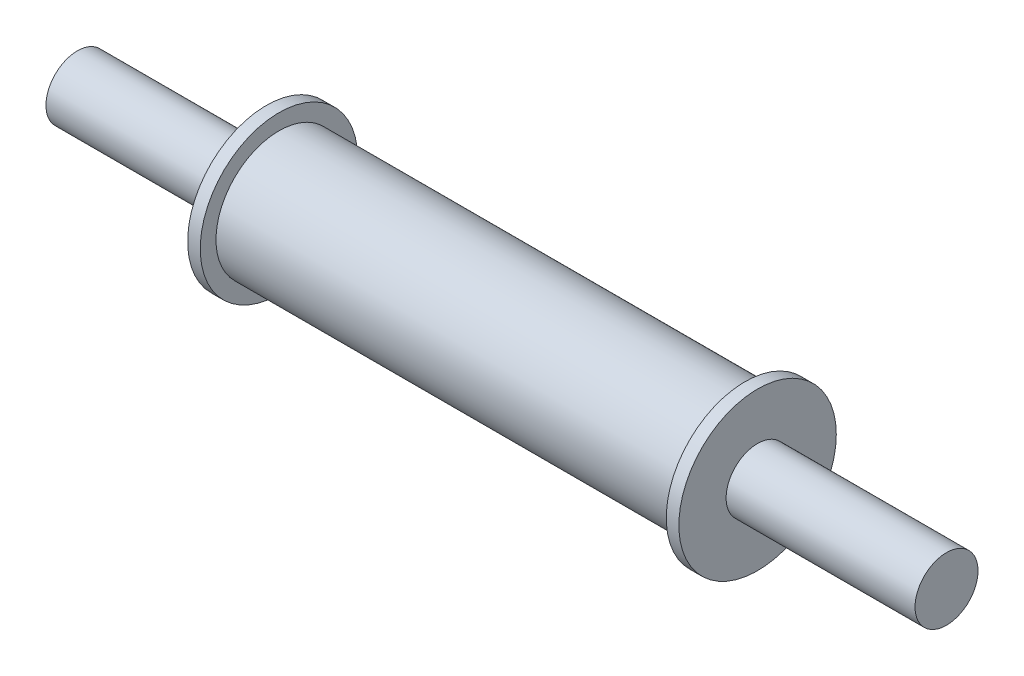
ISO-10303-21;
HEADER;
FILE_DESCRIPTION(('STEP AP214'),'2;1');
FILE_NAME('part.step','',(''),(''),'','','');
FILE_SCHEMA(('AUTOMOTIVE_DESIGN { 1 0 10303 214 1 1 1 1 }'));
ENDSEC;
DATA;
#1=APPLICATION_CONTEXT('core data for automotive mechanical design processes');
#2=APPLICATION_PROTOCOL_DEFINITION('international standard','automotive_design',2000,#1);
#3=PRODUCT_CONTEXT('',#1,'mechanical');
#4=PRODUCT('Part','Part','',(#3));
#5=PRODUCT_RELATED_PRODUCT_CATEGORY('part','',(#4));
#6=PRODUCT_DEFINITION_FORMATION('','',#4);
#7=PRODUCT_DEFINITION_CONTEXT('part definition',#1,'design');
#8=PRODUCT_DEFINITION('design','',#6,#7);
#9=PRODUCT_DEFINITION_SHAPE('','',#8);
#10=(LENGTH_UNIT() NAMED_UNIT(*) SI_UNIT(.MILLI.,.METRE.));
#11=(NAMED_UNIT(*) PLANE_ANGLE_UNIT() SI_UNIT($,.RADIAN.));
#12=(NAMED_UNIT(*) SI_UNIT($,.STERADIAN.) SOLID_ANGLE_UNIT());
#13=UNCERTAINTY_MEASURE_WITH_UNIT(LENGTH_MEASURE(1.E-05),#10,'distance_accuracy_value','');
#14=(GEOMETRIC_REPRESENTATION_CONTEXT(3) GLOBAL_UNCERTAINTY_ASSIGNED_CONTEXT((#13)) GLOBAL_UNIT_ASSIGNED_CONTEXT((#10,
#11,#12)) REPRESENTATION_CONTEXT('',''));
#15=CARTESIAN_POINT('',(0.,0.,0.));
#16=DIRECTION('',(0.,0.,1.));
#17=DIRECTION('',(1.,0.,0.));
#18=AXIS2_PLACEMENT_3D('',#15,#16,#17);
#19=CARTESIAN_POINT('',(37.,0.,0.));
#20=DIRECTION('',(-1.,0.,0.));
#21=DIRECTION('',(0.,0.,1.));
#22=AXIS2_PLACEMENT_3D('',#19,#20,#21);
#23=CYLINDRICAL_SURFACE('',#22,10.);
#24=CARTESIAN_POINT('',(37.,0.,0.));
#25=DIRECTION('',(1.,0.,0.));
#26=DIRECTION('',(0.,0.,-1.));
#27=AXIS2_PLACEMENT_3D('',#24,#25,#26);
#28=CIRCLE('',#27,10.);
#29=CARTESIAN_POINT('',(37.,0.,-10.));
#30=VERTEX_POINT('',#29);
#31=EDGE_CURVE('E34',#30,#30,#28,.T.);
#32=ORIENTED_EDGE('',*,*,#31,.F.);
#33=EDGE_LOOP('',(#32));
#34=FACE_BOUND('',#33,.T.);
#35=CARTESIAN_POINT('',(-37.,0.,0.));
#36=DIRECTION('',(1.,0.,0.));
#37=DIRECTION('',(0.,0.,-1.));
#38=AXIS2_PLACEMENT_3D('',#35,#36,#37);
#39=CIRCLE('',#38,10.);
#40=CARTESIAN_POINT('',(-37.,0.,-10.));
#41=VERTEX_POINT('',#40);
#42=EDGE_CURVE('E53',#41,#41,#39,.T.);
#43=ORIENTED_EDGE('',*,*,#42,.T.);
#44=EDGE_LOOP('',(#43));
#45=FACE_BOUND('',#44,.T.);
#46=ADVANCED_FACE('F31',(#34,#45),#23,.T.);
#47=CARTESIAN_POINT('',(39.,0.,0.));
#48=DIRECTION('',(-1.,0.,0.));
#49=DIRECTION('',(0.,0.,1.));
#50=AXIS2_PLACEMENT_3D('',#47,#48,#49);
#51=CYLINDRICAL_SURFACE('',#50,12.5);
#52=CARTESIAN_POINT('',(39.,0.,0.));
#53=DIRECTION('',(1.,0.,0.));
#54=DIRECTION('',(0.,0.,-1.));
#55=AXIS2_PLACEMENT_3D('',#52,#53,#54);
#56=CIRCLE('',#55,12.5);
#57=CARTESIAN_POINT('',(39.,0.,-12.5));
#58=VERTEX_POINT('',#57);
#59=EDGE_CURVE('E42',#58,#58,#56,.T.);
#60=ORIENTED_EDGE('',*,*,#59,.F.);
#61=EDGE_LOOP('',(#60));
#62=FACE_BOUND('',#61,.T.);
#63=CARTESIAN_POINT('',(37.,0.,0.));
#64=DIRECTION('',(1.,0.,0.));
#65=DIRECTION('',(0.,0.,-1.));
#66=AXIS2_PLACEMENT_3D('',#63,#64,#65);
#67=CIRCLE('',#66,12.5);
#68=CARTESIAN_POINT('',(37.,0.,-12.5));
#69=VERTEX_POINT('',#68);
#70=EDGE_CURVE('E48',#69,#69,#67,.T.);
#71=ORIENTED_EDGE('',*,*,#70,.T.);
#72=EDGE_LOOP('',(#71));
#73=FACE_BOUND('',#72,.T.);
#74=ADVANCED_FACE('F85',(#62,#73),#51,.T.);
#75=CARTESIAN_POINT('',(39.,0.,0.));
#76=DIRECTION('',(1.,0.,0.));
#77=DIRECTION('',(0.,0.,-1.));
#78=AXIS2_PLACEMENT_3D('',#75,#76,#77);
#79=PLANE('',#78);
#80=CARTESIAN_POINT('',(39.,0.,0.));
#81=DIRECTION('',(1.,0.,0.));
#82=DIRECTION('',(0.,0.,-1.));
#83=AXIS2_PLACEMENT_3D('',#80,#81,#82);
#84=CIRCLE('',#83,5.);
#85=CARTESIAN_POINT('',(39.,0.,-5.));
#86=VERTEX_POINT('',#85);
#87=EDGE_CURVE('E10',#86,#86,#84,.T.);
#88=ORIENTED_EDGE('',*,*,#87,.F.);
#89=EDGE_LOOP('',(#88));
#90=FACE_BOUND('',#89,.T.);
#91=ORIENTED_EDGE('',*,*,#59,.T.);
#92=EDGE_LOOP('',(#91));
#93=FACE_BOUND('',#92,.T.);
#94=ADVANCED_FACE('F90',(#90,#93),#79,.T.);
#95=CARTESIAN_POINT('',(37.,0.,0.));
#96=DIRECTION('',(1.,0.,0.));
#97=DIRECTION('',(0.,0.,-1.));
#98=AXIS2_PLACEMENT_3D('',#95,#96,#97);
#99=PLANE('',#98);
#100=ORIENTED_EDGE('',*,*,#31,.T.);
#101=EDGE_LOOP('',(#100));
#102=FACE_BOUND('',#101,.T.);
#103=ORIENTED_EDGE('',*,*,#70,.F.);
#104=EDGE_LOOP('',(#103));
#105=FACE_BOUND('',#104,.T.);
#106=ADVANCED_FACE('F94',(#102,#105),#99,.F.);
#107=CARTESIAN_POINT('',(69.,0.,0.));
#108=DIRECTION('',(-1.,0.,0.));
#109=DIRECTION('',(0.,0.,1.));
#110=AXIS2_PLACEMENT_3D('',#107,#108,#109);
#111=CYLINDRICAL_SURFACE('',#110,5.);
#112=CARTESIAN_POINT('',(69.,0.,0.));
#113=DIRECTION('',(1.,0.,0.));
#114=DIRECTION('',(0.,0.,-1.));
#115=AXIS2_PLACEMENT_3D('',#112,#113,#114);
#116=CIRCLE('',#115,5.);
#117=CARTESIAN_POINT('',(69.,0.,-5.));
#118=VERTEX_POINT('',#117);
#119=EDGE_CURVE('E45',#118,#118,#116,.T.);
#120=ORIENTED_EDGE('',*,*,#119,.F.);
#121=EDGE_LOOP('',(#120));
#122=FACE_BOUND('',#121,.T.);
#123=ORIENTED_EDGE('',*,*,#87,.T.);
#124=EDGE_LOOP('',(#123));
#125=FACE_BOUND('',#124,.T.);
#126=ADVANCED_FACE('F97',(#122,#125),#111,.T.);
#127=CARTESIAN_POINT('',(69.,0.,0.));
#128=DIRECTION('',(1.,0.,0.));
#129=DIRECTION('',(0.,0.,-1.));
#130=AXIS2_PLACEMENT_3D('',#127,#128,#129);
#131=PLANE('',#130);
#132=ORIENTED_EDGE('',*,*,#119,.T.);
#133=EDGE_LOOP('',(#132));
#134=FACE_BOUND('',#133,.T.);
#135=ADVANCED_FACE('F103',(#134),#131,.T.);
#136=CARTESIAN_POINT('',(-39.,0.,0.));
#137=DIRECTION('',(1.,0.,0.));
#138=DIRECTION('',(0.,0.,-1.));
#139=AXIS2_PLACEMENT_3D('',#136,#137,#138);
#140=CYLINDRICAL_SURFACE('',#139,12.5);
#141=CARTESIAN_POINT('',(-39.,0.,0.));
#142=DIRECTION('',(1.,0.,0.));
#143=DIRECTION('',(0.,0.,-1.));
#144=AXIS2_PLACEMENT_3D('',#141,#142,#143);
#145=CIRCLE('',#144,12.5);
#146=CARTESIAN_POINT('',(-39.,0.,-12.5));
#147=VERTEX_POINT('',#146);
#148=EDGE_CURVE('E57',#147,#147,#145,.T.);
#149=ORIENTED_EDGE('',*,*,#148,.T.);
#150=EDGE_LOOP('',(#149));
#151=FACE_BOUND('',#150,.T.);
#152=CARTESIAN_POINT('',(-37.,0.,0.));
#153=DIRECTION('',(1.,0.,0.));
#154=DIRECTION('',(0.,0.,-1.));
#155=AXIS2_PLACEMENT_3D('',#152,#153,#154);
#156=CIRCLE('',#155,12.5);
#157=CARTESIAN_POINT('',(-37.,0.,-12.5));
#158=VERTEX_POINT('',#157);
#159=EDGE_CURVE('E61',#158,#158,#156,.T.);
#160=ORIENTED_EDGE('',*,*,#159,.F.);
#161=EDGE_LOOP('',(#160));
#162=FACE_BOUND('',#161,.T.);
#163=ADVANCED_FACE('F111',(#151,#162),#140,.T.);
#164=CARTESIAN_POINT('',(-39.,0.,0.));
#165=DIRECTION('',(-1.,0.,0.));
#166=DIRECTION('',(0.,0.,-1.));
#167=AXIS2_PLACEMENT_3D('',#164,#165,#166);
#168=PLANE('',#167);
#169=CARTESIAN_POINT('',(-39.,0.,0.));
#170=DIRECTION('',(1.,0.,0.));
#171=DIRECTION('',(0.,0.,-1.));
#172=AXIS2_PLACEMENT_3D('',#169,#170,#171);
#173=CIRCLE('',#172,5.);
#174=CARTESIAN_POINT('',(-39.,0.,-5.));
#175=VERTEX_POINT('',#174);
#176=EDGE_CURVE('E67',#175,#175,#173,.T.);
#177=ORIENTED_EDGE('',*,*,#176,.T.);
#178=EDGE_LOOP('',(#177));
#179=FACE_BOUND('',#178,.T.);
#180=ORIENTED_EDGE('',*,*,#148,.F.);
#181=EDGE_LOOP('',(#180));
#182=FACE_BOUND('',#181,.T.);
#183=ADVANCED_FACE('F114',(#179,#182),#168,.T.);
#184=CARTESIAN_POINT('',(-37.,0.,0.));
#185=DIRECTION('',(-1.,0.,0.));
#186=DIRECTION('',(0.,0.,-1.));
#187=AXIS2_PLACEMENT_3D('',#184,#185,#186);
#188=PLANE('',#187);
#189=ORIENTED_EDGE('',*,*,#42,.F.);
#190=EDGE_LOOP('',(#189));
#191=FACE_BOUND('',#190,.T.);
#192=ORIENTED_EDGE('',*,*,#159,.T.);
#193=EDGE_LOOP('',(#192));
#194=FACE_BOUND('',#193,.T.);
#195=ADVANCED_FACE('F82',(#191,#194),#188,.F.);
#196=CARTESIAN_POINT('',(-69.,0.,0.));
#197=DIRECTION('',(1.,0.,0.));
#198=DIRECTION('',(0.,0.,-1.));
#199=AXIS2_PLACEMENT_3D('',#196,#197,#198);
#200=CYLINDRICAL_SURFACE('',#199,5.);
#201=CARTESIAN_POINT('',(-69.,0.,0.));
#202=DIRECTION('',(1.,0.,0.));
#203=DIRECTION('',(0.,0.,-1.));
#204=AXIS2_PLACEMENT_3D('',#201,#202,#203);
#205=CIRCLE('',#204,5.);
#206=CARTESIAN_POINT('',(-69.,0.,-5.));
#207=VERTEX_POINT('',#206);
#208=EDGE_CURVE('E65',#207,#207,#205,.T.);
#209=ORIENTED_EDGE('',*,*,#208,.T.);
#210=EDGE_LOOP('',(#209));
#211=FACE_BOUND('',#210,.T.);
#212=ORIENTED_EDGE('',*,*,#176,.F.);
#213=EDGE_LOOP('',(#212));
#214=FACE_BOUND('',#213,.T.);
#215=ADVANCED_FACE('F73',(#211,#214),#200,.T.);
#216=CARTESIAN_POINT('',(-69.,0.,0.));
#217=DIRECTION('',(-1.,0.,0.));
#218=DIRECTION('',(0.,0.,-1.));
#219=AXIS2_PLACEMENT_3D('',#216,#217,#218);
#220=PLANE('',#219);
#221=ORIENTED_EDGE('',*,*,#208,.F.);
#222=EDGE_LOOP('',(#221));
#223=FACE_BOUND('',#222,.T.);
#224=ADVANCED_FACE('F76',(#223),#220,.T.);
#225=CLOSED_SHELL('',(#46,#74,#94,#106,#126,#135,#163,#183,#195,#215,#224));
#226=MANIFOLD_SOLID_BREP('B2',#225);
#227=ADVANCED_BREP_SHAPE_REPRESENTATION('',(#18,#226),#14);
#228=SHAPE_DEFINITION_REPRESENTATION(#9,#227);
ENDSEC;
END-ISO-10303-21;
